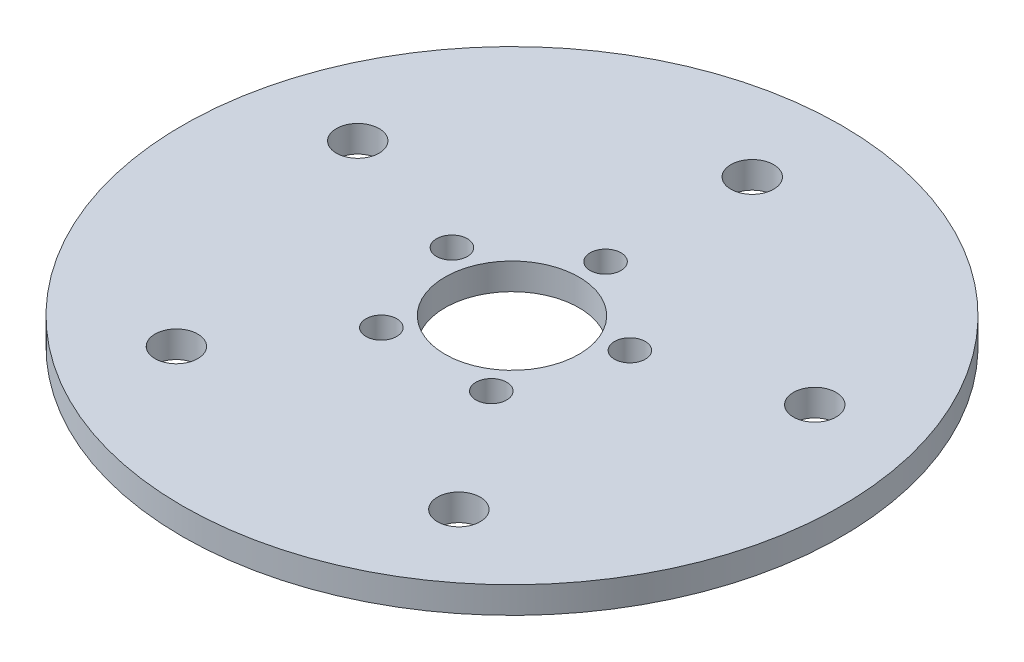
ISO-10303-21;
HEADER;
FILE_DESCRIPTION(('STEP AP214'),'2;1');
FILE_NAME('part.step','',(''),(''),'','','');
FILE_SCHEMA(('AUTOMOTIVE_DESIGN { 1 0 10303 214 1 1 1 1 }'));
ENDSEC;
DATA;
#1=APPLICATION_CONTEXT('core data for automotive mechanical design processes');
#2=APPLICATION_PROTOCOL_DEFINITION('international standard','automotive_design',2000,#1);
#3=PRODUCT_CONTEXT('',#1,'mechanical');
#4=PRODUCT('Part','Part','',(#3));
#5=PRODUCT_RELATED_PRODUCT_CATEGORY('part','',(#4));
#6=PRODUCT_DEFINITION_FORMATION('','',#4);
#7=PRODUCT_DEFINITION_CONTEXT('part definition',#1,'design');
#8=PRODUCT_DEFINITION('design','',#6,#7);
#9=PRODUCT_DEFINITION_SHAPE('','',#8);
#10=(LENGTH_UNIT() NAMED_UNIT(*) SI_UNIT(.MILLI.,.METRE.));
#11=(NAMED_UNIT(*) PLANE_ANGLE_UNIT() SI_UNIT($,.RADIAN.));
#12=(NAMED_UNIT(*) SI_UNIT($,.STERADIAN.) SOLID_ANGLE_UNIT());
#13=UNCERTAINTY_MEASURE_WITH_UNIT(LENGTH_MEASURE(1.E-05),#10,'distance_accuracy_value','');
#14=(GEOMETRIC_REPRESENTATION_CONTEXT(3) GLOBAL_UNCERTAINTY_ASSIGNED_CONTEXT((#13)) GLOBAL_UNIT_ASSIGNED_CONTEXT((#10,
#11,#12)) REPRESENTATION_CONTEXT('',''));
#15=CARTESIAN_POINT('',(0.,0.,0.));
#16=DIRECTION('',(0.,0.,1.));
#17=DIRECTION('',(1.,0.,0.));
#18=AXIS2_PLACEMENT_3D('',#15,#16,#17);
#19=CARTESIAN_POINT('',(0.,803.941424119783,-1.40859720825637E-13));
#20=DIRECTION('',(0.,1.,0.));
#21=DIRECTION('',(0.,0.,1.));
#22=AXIS2_PLACEMENT_3D('',#19,#20,#21);
#23=CYLINDRICAL_SURFACE('',#22,39.37);
#24=CARTESIAN_POINT('',(0.,803.941424119783,-1.40859720825637E-13));
#25=DIRECTION('',(0.,1.,0.));
#26=DIRECTION('',(0.,0.,1.));
#27=AXIS2_PLACEMENT_3D('',#24,#25,#26);
#28=CIRCLE('',#27,39.37);
#29=CARTESIAN_POINT('',(0.,803.941424119783,39.3699999999999));
#30=VERTEX_POINT('',#29);
#31=EDGE_CURVE('E10',#30,#30,#28,.T.);
#32=ORIENTED_EDGE('',*,*,#31,.T.);
#33=EDGE_LOOP('',(#32));
#34=FACE_BOUND('',#33,.T.);
#35=CARTESIAN_POINT('',(0.,807.116424119783,-1.41054133505002E-13));
#36=DIRECTION('',(0.,1.,0.));
#37=DIRECTION('',(0.,0.,1.));
#38=AXIS2_PLACEMENT_3D('',#35,#36,#37);
#39=CIRCLE('',#38,39.37);
#40=CARTESIAN_POINT('',(0.,807.116424119783,39.3699999999999));
#41=VERTEX_POINT('',#40);
#42=EDGE_CURVE('E40',#41,#41,#39,.T.);
#43=ORIENTED_EDGE('',*,*,#42,.F.);
#44=EDGE_LOOP('',(#43));
#45=FACE_BOUND('',#44,.T.);
#46=ADVANCED_FACE('F37',(#34,#45),#23,.T.);
#47=CARTESIAN_POINT('',(0.,803.941424119783,-1.40859720825637E-13));
#48=DIRECTION('',(0.,1.,0.));
#49=DIRECTION('',(0.,0.,1.));
#50=AXIS2_PLACEMENT_3D('',#47,#48,#49);
#51=PLANE('',#50);
#52=CARTESIAN_POINT('',(-27.2972241307035,803.941424119783,-8.8694057725499));
#53=DIRECTION('',(0.,1.,0.));
#54=DIRECTION('',(0.,0.,1.));
#55=AXIS2_PLACEMENT_3D('',#52,#53,#54);
#56=CIRCLE('',#55,2.5527);
#57=CARTESIAN_POINT('',(-27.2972241307035,803.941424119783,-6.3167057725499));
#58=VERTEX_POINT('',#57);
#59=EDGE_CURVE('E55',#58,#58,#56,.T.);
#60=ORIENTED_EDGE('',*,*,#59,.T.);
#61=EDGE_LOOP('',(#60));
#62=FACE_BOUND('',#61,.T.);
#63=CARTESIAN_POINT('',(-16.8706123112986,803.941424119783,23.2204057725496));
#64=DIRECTION('',(0.,1.,0.));
#65=DIRECTION('',(0.,0.,1.));
#66=AXIS2_PLACEMENT_3D('',#63,#64,#65);
#67=CIRCLE('',#66,2.5527);
#68=CARTESIAN_POINT('',(-16.8706123112986,803.941424119783,25.7731057725496));
#69=VERTEX_POINT('',#68);
#70=EDGE_CURVE('E61',#69,#69,#67,.T.);
#71=ORIENTED_EDGE('',*,*,#70,.T.);
#72=EDGE_LOOP('',(#71));
#73=FACE_BOUND('',#72,.T.);
#74=CARTESIAN_POINT('',(6.56908797962068,803.941424119783,9.04157392913436));
#75=DIRECTION('',(0.,1.,0.));
#76=DIRECTION('',(0.,0.,1.));
#77=AXIS2_PLACEMENT_3D('',#74,#75,#76);
#78=CIRCLE('',#77,1.84150000000011);
#79=CARTESIAN_POINT('',(6.56908797962068,803.941424119783,10.8830739291345));
#80=VERTEX_POINT('',#79);
#81=EDGE_CURVE('E80',#80,#80,#78,.T.);
#82=ORIENTED_EDGE('',*,*,#81,.T.);
#83=EDGE_LOOP('',(#82));
#84=FACE_BOUND('',#83,.T.);
#85=CARTESIAN_POINT('',(0.,803.941424119783,-28.7020000000001));
#86=DIRECTION('',(0.,1.,0.));
#87=DIRECTION('',(0.,0.,1.));
#88=AXIS2_PLACEMENT_3D('',#85,#86,#87);
#89=CIRCLE('',#88,2.5527);
#90=CARTESIAN_POINT('',(0.,803.941424119783,-26.1493000000001));
#91=VERTEX_POINT('',#90);
#92=EDGE_CURVE('E87',#91,#91,#89,.T.);
#93=ORIENTED_EDGE('',*,*,#92,.T.);
#94=EDGE_LOOP('',(#93));
#95=FACE_BOUND('',#94,.T.);
#96=CARTESIAN_POINT('',(10.6290076261146,803.941424119783,-3.45357392913442));
#97=DIRECTION('',(0.,1.,0.));
#98=DIRECTION('',(0.,0.,1.));
#99=AXIS2_PLACEMENT_3D('',#96,#97,#98);
#100=CIRCLE('',#99,1.84150000000005);
#101=CARTESIAN_POINT('',(10.6290076261146,803.941424119783,-1.61207392913437));
#102=VERTEX_POINT('',#101);
#103=EDGE_CURVE('E68',#102,#102,#100,.T.);
#104=ORIENTED_EDGE('',*,*,#103,.T.);
#105=EDGE_LOOP('',(#104));
#106=FACE_BOUND('',#105,.T.);
#107=CARTESIAN_POINT('',(0.,803.941424119783,-11.1760000000001));
#108=DIRECTION('',(0.,1.,0.));
#109=DIRECTION('',(0.,0.,1.));
#110=AXIS2_PLACEMENT_3D('',#107,#108,#109);
#111=CIRCLE('',#110,1.84150000000004);
#112=CARTESIAN_POINT('',(0.,803.941424119783,-9.33450000000008));
#113=VERTEX_POINT('',#112);
#114=EDGE_CURVE('E75',#113,#113,#111,.T.);
#115=ORIENTED_EDGE('',*,*,#114,.T.);
#116=EDGE_LOOP('',(#115));
#117=FACE_BOUND('',#116,.T.);
#118=CARTESIAN_POINT('',(-6.56908797962076,803.941424119783,9.04157392913436));
#119=DIRECTION('',(0.,1.,0.));
#120=DIRECTION('',(0.,0.,1.));
#121=AXIS2_PLACEMENT_3D('',#118,#119,#120);
#122=CIRCLE('',#121,1.84150000000009);
#123=CARTESIAN_POINT('',(-6.56908797962076,803.941424119783,10.8830739291344));
#124=VERTEX_POINT('',#123);
#125=EDGE_CURVE('E109',#124,#124,#122,.T.);
#126=ORIENTED_EDGE('',*,*,#125,.T.);
#127=EDGE_LOOP('',(#126));
#128=FACE_BOUND('',#127,.T.);
#129=CARTESIAN_POINT('',(-10.6290076261147,803.941424119783,-3.45357392913442));
#130=DIRECTION('',(0.,1.,0.));
#131=DIRECTION('',(0.,0.,1.));
#132=AXIS2_PLACEMENT_3D('',#129,#130,#131);
#133=CIRCLE('',#132,1.84150000000005);
#134=CARTESIAN_POINT('',(-10.6290076261147,803.941424119783,-1.61207392913437));
#135=VERTEX_POINT('',#134);
#136=EDGE_CURVE('E103',#135,#135,#133,.T.);
#137=ORIENTED_EDGE('',*,*,#136,.T.);
#138=EDGE_LOOP('',(#137));
#139=FACE_BOUND('',#138,.T.);
#140=CARTESIAN_POINT('',(27.2972241307035,803.941424119783,-8.86940577254987));
#141=DIRECTION('',(0.,1.,0.));
#142=DIRECTION('',(0.,0.,1.));
#143=AXIS2_PLACEMENT_3D('',#140,#141,#142);
#144=CIRCLE('',#143,2.5527);
#145=CARTESIAN_POINT('',(27.2972241307035,803.941424119783,-6.31670577254987));
#146=VERTEX_POINT('',#145);
#147=EDGE_CURVE('E97',#146,#146,#144,.T.);
#148=ORIENTED_EDGE('',*,*,#147,.T.);
#149=EDGE_LOOP('',(#148));
#150=FACE_BOUND('',#149,.T.);
#151=CARTESIAN_POINT('',(16.8706123112985,803.941424119783,23.2204057725496));
#152=DIRECTION('',(0.,1.,0.));
#153=DIRECTION('',(0.,0.,1.));
#154=AXIS2_PLACEMENT_3D('',#151,#152,#153);
#155=CIRCLE('',#154,2.5527);
#156=CARTESIAN_POINT('',(16.8706123112985,803.941424119783,25.7731057725496));
#157=VERTEX_POINT('',#156);
#158=EDGE_CURVE('E67',#157,#157,#155,.T.);
#159=ORIENTED_EDGE('',*,*,#158,.T.);
#160=EDGE_LOOP('',(#159));
#161=FACE_BOUND('',#160,.T.);
#162=CARTESIAN_POINT('',(0.,803.941424119783,0.));
#163=DIRECTION('',(0.,1.,0.));
#164=DIRECTION('',(0.,0.,1.));
#165=AXIS2_PLACEMENT_3D('',#162,#163,#164);
#166=CIRCLE('',#165,8.00100000000001);
#167=CARTESIAN_POINT('',(0.,803.941424119783,8.00099999999996));
#168=VERTEX_POINT('',#167);
#169=EDGE_CURVE('E47',#168,#168,#166,.T.);
#170=ORIENTED_EDGE('',*,*,#169,.T.);
#171=EDGE_LOOP('',(#170));
#172=FACE_BOUND('',#171,.T.);
#173=ORIENTED_EDGE('',*,*,#31,.F.);
#174=EDGE_LOOP('',(#173));
#175=FACE_BOUND('',#174,.T.);
#176=ADVANCED_FACE('F121',(#62,#73,#84,#95,#106,#117,#128,#139,#150,#161,#172,#175),#51,.F.);
#177=CARTESIAN_POINT('',(0.,807.116424119783,-1.41054133505002E-13));
#178=DIRECTION('',(0.,1.,0.));
#179=DIRECTION('',(0.,0.,1.));
#180=AXIS2_PLACEMENT_3D('',#177,#178,#179);
#181=PLANE('',#180);
#182=CARTESIAN_POINT('',(-27.2972241307035,807.116424119783,-8.8694057725499));
#183=DIRECTION('',(0.,1.,0.));
#184=DIRECTION('',(0.,0.,1.));
#185=AXIS2_PLACEMENT_3D('',#182,#183,#184);
#186=CIRCLE('',#185,2.5527);
#187=CARTESIAN_POINT('',(-27.2972241307035,807.116424119783,-6.3167057725499));
#188=VERTEX_POINT('',#187);
#189=EDGE_CURVE('E58',#188,#188,#186,.T.);
#190=ORIENTED_EDGE('',*,*,#189,.F.);
#191=EDGE_LOOP('',(#190));
#192=FACE_BOUND('',#191,.T.);
#193=CARTESIAN_POINT('',(-16.8706123112986,807.116424119783,23.2204057725496));
#194=DIRECTION('',(0.,1.,0.));
#195=DIRECTION('',(0.,0.,1.));
#196=AXIS2_PLACEMENT_3D('',#193,#194,#195);
#197=CIRCLE('',#196,2.5527);
#198=CARTESIAN_POINT('',(-16.8706123112986,807.116424119783,25.7731057725496));
#199=VERTEX_POINT('',#198);
#200=EDGE_CURVE('E64',#199,#199,#197,.T.);
#201=ORIENTED_EDGE('',*,*,#200,.F.);
#202=EDGE_LOOP('',(#201));
#203=FACE_BOUND('',#202,.T.);
#204=CARTESIAN_POINT('',(6.56908797962068,807.116424119783,9.04157392913436));
#205=DIRECTION('',(0.,1.,0.));
#206=DIRECTION('',(0.,0.,1.));
#207=AXIS2_PLACEMENT_3D('',#204,#205,#206);
#208=CIRCLE('',#207,1.84150000000011);
#209=CARTESIAN_POINT('',(6.56908797962068,807.116424119783,10.8830739291345));
#210=VERTEX_POINT('',#209);
#211=EDGE_CURVE('E83',#210,#210,#208,.T.);
#212=ORIENTED_EDGE('',*,*,#211,.F.);
#213=EDGE_LOOP('',(#212));
#214=FACE_BOUND('',#213,.T.);
#215=CARTESIAN_POINT('',(0.,807.116424119783,-28.7020000000001));
#216=DIRECTION('',(0.,1.,0.));
#217=DIRECTION('',(0.,0.,1.));
#218=AXIS2_PLACEMENT_3D('',#215,#216,#217);
#219=CIRCLE('',#218,2.5527);
#220=CARTESIAN_POINT('',(0.,807.116424119783,-26.1493000000001));
#221=VERTEX_POINT('',#220);
#222=EDGE_CURVE('E72',#221,#221,#219,.T.);
#223=ORIENTED_EDGE('',*,*,#222,.F.);
#224=EDGE_LOOP('',(#223));
#225=FACE_BOUND('',#224,.T.);
#226=CARTESIAN_POINT('',(10.6290076261146,807.116424119783,-3.45357392913442));
#227=DIRECTION('',(0.,1.,0.));
#228=DIRECTION('',(0.,0.,1.));
#229=AXIS2_PLACEMENT_3D('',#226,#227,#228);
#230=CIRCLE('',#229,1.84150000000005);
#231=CARTESIAN_POINT('',(10.6290076261146,807.116424119783,-1.61207392913437));
#232=VERTEX_POINT('',#231);
#233=EDGE_CURVE('E71',#232,#232,#230,.T.);
#234=ORIENTED_EDGE('',*,*,#233,.F.);
#235=EDGE_LOOP('',(#234));
#236=FACE_BOUND('',#235,.T.);
#237=CARTESIAN_POINT('',(0.,807.116424119783,-11.1760000000001));
#238=DIRECTION('',(0.,1.,0.));
#239=DIRECTION('',(0.,0.,1.));
#240=AXIS2_PLACEMENT_3D('',#237,#238,#239);
#241=CIRCLE('',#240,1.84150000000004);
#242=CARTESIAN_POINT('',(0.,807.116424119783,-9.33450000000008));
#243=VERTEX_POINT('',#242);
#244=EDGE_CURVE('E52',#243,#243,#241,.T.);
#245=ORIENTED_EDGE('',*,*,#244,.F.);
#246=EDGE_LOOP('',(#245));
#247=FACE_BOUND('',#246,.T.);
#248=CARTESIAN_POINT('',(-6.56908797962076,807.116424119783,9.04157392913436));
#249=DIRECTION('',(0.,1.,0.));
#250=DIRECTION('',(0.,0.,1.));
#251=AXIS2_PLACEMENT_3D('',#248,#249,#250);
#252=CIRCLE('',#251,1.84150000000009);
#253=CARTESIAN_POINT('',(-6.56908797962076,807.116424119783,10.8830739291344));
#254=VERTEX_POINT('',#253);
#255=EDGE_CURVE('E84',#254,#254,#252,.T.);
#256=ORIENTED_EDGE('',*,*,#255,.F.);
#257=EDGE_LOOP('',(#256));
#258=FACE_BOUND('',#257,.T.);
#259=CARTESIAN_POINT('',(-10.6290076261147,807.116424119783,-3.45357392913442));
#260=DIRECTION('',(0.,1.,0.));
#261=DIRECTION('',(0.,0.,1.));
#262=AXIS2_PLACEMENT_3D('',#259,#260,#261);
#263=CIRCLE('',#262,1.84150000000005);
#264=CARTESIAN_POINT('',(-10.6290076261147,807.116424119783,-1.61207392913437));
#265=VERTEX_POINT('',#264);
#266=EDGE_CURVE('E106',#265,#265,#263,.T.);
#267=ORIENTED_EDGE('',*,*,#266,.F.);
#268=EDGE_LOOP('',(#267));
#269=FACE_BOUND('',#268,.T.);
#270=CARTESIAN_POINT('',(27.2972241307035,807.116424119783,-8.86940577254987));
#271=DIRECTION('',(0.,1.,0.));
#272=DIRECTION('',(0.,0.,1.));
#273=AXIS2_PLACEMENT_3D('',#270,#271,#272);
#274=CIRCLE('',#273,2.5527);
#275=CARTESIAN_POINT('',(27.2972241307035,807.116424119783,-6.31670577254987));
#276=VERTEX_POINT('',#275);
#277=EDGE_CURVE('E100',#276,#276,#274,.T.);
#278=ORIENTED_EDGE('',*,*,#277,.F.);
#279=EDGE_LOOP('',(#278));
#280=FACE_BOUND('',#279,.T.);
#281=CARTESIAN_POINT('',(16.8706123112985,807.116424119783,23.2204057725496));
#282=DIRECTION('',(0.,1.,0.));
#283=DIRECTION('',(0.,0.,1.));
#284=AXIS2_PLACEMENT_3D('',#281,#282,#283);
#285=CIRCLE('',#284,2.5527);
#286=CARTESIAN_POINT('',(16.8706123112985,807.116424119783,25.7731057725496));
#287=VERTEX_POINT('',#286);
#288=EDGE_CURVE('E94',#287,#287,#285,.T.);
#289=ORIENTED_EDGE('',*,*,#288,.F.);
#290=EDGE_LOOP('',(#289));
#291=FACE_BOUND('',#290,.T.);
#292=CARTESIAN_POINT('',(0.,807.116424119783,0.));
#293=DIRECTION('',(0.,1.,0.));
#294=DIRECTION('',(0.,0.,1.));
#295=AXIS2_PLACEMENT_3D('',#292,#293,#294);
#296=CIRCLE('',#295,8.00100000000001);
#297=CARTESIAN_POINT('',(0.,807.116424119783,8.00099999999996));
#298=VERTEX_POINT('',#297);
#299=EDGE_CURVE('E49',#298,#298,#296,.T.);
#300=ORIENTED_EDGE('',*,*,#299,.F.);
#301=EDGE_LOOP('',(#300));
#302=FACE_BOUND('',#301,.T.);
#303=ORIENTED_EDGE('',*,*,#42,.T.);
#304=EDGE_LOOP('',(#303));
#305=FACE_BOUND('',#304,.T.);
#306=ADVANCED_FACE('F117',(#192,#203,#214,#225,#236,#247,#258,#269,#280,#291,#302,#305),#181,.T.);
#307=CARTESIAN_POINT('',(0.,803.941424119783,0.));
#308=DIRECTION('',(0.,1.,0.));
#309=DIRECTION('',(0.,0.,1.));
#310=AXIS2_PLACEMENT_3D('',#307,#308,#309);
#311=CYLINDRICAL_SURFACE('',#310,8.00100000000001);
#312=ORIENTED_EDGE('',*,*,#169,.F.);
#313=EDGE_LOOP('',(#312));
#314=FACE_BOUND('',#313,.T.);
#315=ORIENTED_EDGE('',*,*,#299,.T.);
#316=EDGE_LOOP('',(#315));
#317=FACE_BOUND('',#316,.T.);
#318=ADVANCED_FACE('F120',(#314,#317),#311,.F.);
#319=CARTESIAN_POINT('',(16.8706123112985,803.941424119783,23.2204057725496));
#320=DIRECTION('',(0.,1.,0.));
#321=DIRECTION('',(0.,0.,1.));
#322=AXIS2_PLACEMENT_3D('',#319,#320,#321);
#323=CYLINDRICAL_SURFACE('',#322,2.5527);
#324=ORIENTED_EDGE('',*,*,#158,.F.);
#325=EDGE_LOOP('',(#324));
#326=FACE_BOUND('',#325,.T.);
#327=ORIENTED_EDGE('',*,*,#288,.T.);
#328=EDGE_LOOP('',(#327));
#329=FACE_BOUND('',#328,.T.);
#330=ADVANCED_FACE('F145',(#326,#329),#323,.F.);
#331=CARTESIAN_POINT('',(27.2972241307035,803.941424119783,-8.86940577254987));
#332=DIRECTION('',(0.,1.,0.));
#333=DIRECTION('',(0.,0.,1.));
#334=AXIS2_PLACEMENT_3D('',#331,#332,#333);
#335=CYLINDRICAL_SURFACE('',#334,2.5527);
#336=ORIENTED_EDGE('',*,*,#147,.F.);
#337=EDGE_LOOP('',(#336));
#338=FACE_BOUND('',#337,.T.);
#339=ORIENTED_EDGE('',*,*,#277,.T.);
#340=EDGE_LOOP('',(#339));
#341=FACE_BOUND('',#340,.T.);
#342=ADVANCED_FACE('F173',(#338,#341),#335,.F.);
#343=CARTESIAN_POINT('',(-10.6290076261147,803.941424119783,-3.45357392913442));
#344=DIRECTION('',(0.,1.,0.));
#345=DIRECTION('',(0.,0.,1.));
#346=AXIS2_PLACEMENT_3D('',#343,#344,#345);
#347=CYLINDRICAL_SURFACE('',#346,1.84150000000005);
#348=ORIENTED_EDGE('',*,*,#136,.F.);
#349=EDGE_LOOP('',(#348));
#350=FACE_BOUND('',#349,.T.);
#351=ORIENTED_EDGE('',*,*,#266,.T.);
#352=EDGE_LOOP('',(#351));
#353=FACE_BOUND('',#352,.T.);
#354=ADVANCED_FACE('F177',(#350,#353),#347,.F.);
#355=CARTESIAN_POINT('',(-6.56908797962076,803.941424119783,9.04157392913436));
#356=DIRECTION('',(0.,1.,0.));
#357=DIRECTION('',(0.,0.,1.));
#358=AXIS2_PLACEMENT_3D('',#355,#356,#357);
#359=CYLINDRICAL_SURFACE('',#358,1.84150000000009);
#360=ORIENTED_EDGE('',*,*,#125,.F.);
#361=EDGE_LOOP('',(#360));
#362=FACE_BOUND('',#361,.T.);
#363=ORIENTED_EDGE('',*,*,#255,.T.);
#364=EDGE_LOOP('',(#363));
#365=FACE_BOUND('',#364,.T.);
#366=ADVANCED_FACE('F115',(#362,#365),#359,.F.);
#367=CARTESIAN_POINT('',(0.,803.941424119783,-11.1760000000001));
#368=DIRECTION('',(0.,1.,0.));
#369=DIRECTION('',(0.,0.,1.));
#370=AXIS2_PLACEMENT_3D('',#367,#368,#369);
#371=CYLINDRICAL_SURFACE('',#370,1.84150000000004);
#372=ORIENTED_EDGE('',*,*,#114,.F.);
#373=EDGE_LOOP('',(#372));
#374=FACE_BOUND('',#373,.T.);
#375=ORIENTED_EDGE('',*,*,#244,.T.);
#376=EDGE_LOOP('',(#375));
#377=FACE_BOUND('',#376,.T.);
#378=ADVANCED_FACE('F160',(#374,#377),#371,.F.);
#379=CARTESIAN_POINT('',(10.6290076261146,803.941424119783,-3.45357392913442));
#380=DIRECTION('',(0.,1.,0.));
#381=DIRECTION('',(0.,0.,1.));
#382=AXIS2_PLACEMENT_3D('',#379,#380,#381);
#383=CYLINDRICAL_SURFACE('',#382,1.84150000000005);
#384=ORIENTED_EDGE('',*,*,#103,.F.);
#385=EDGE_LOOP('',(#384));
#386=FACE_BOUND('',#385,.T.);
#387=ORIENTED_EDGE('',*,*,#233,.T.);
#388=EDGE_LOOP('',(#387));
#389=FACE_BOUND('',#388,.T.);
#390=ADVANCED_FACE('F156',(#386,#389),#383,.F.);
#391=CARTESIAN_POINT('',(0.,803.941424119783,-28.7020000000001));
#392=DIRECTION('',(0.,1.,0.));
#393=DIRECTION('',(0.,0.,1.));
#394=AXIS2_PLACEMENT_3D('',#391,#392,#393);
#395=CYLINDRICAL_SURFACE('',#394,2.5527);
#396=ORIENTED_EDGE('',*,*,#92,.F.);
#397=EDGE_LOOP('',(#396));
#398=FACE_BOUND('',#397,.T.);
#399=ORIENTED_EDGE('',*,*,#222,.T.);
#400=EDGE_LOOP('',(#399));
#401=FACE_BOUND('',#400,.T.);
#402=ADVANCED_FACE('F159',(#398,#401),#395,.F.);
#403=CARTESIAN_POINT('',(6.56908797962068,803.941424119783,9.04157392913436));
#404=DIRECTION('',(0.,1.,0.));
#405=DIRECTION('',(0.,0.,1.));
#406=AXIS2_PLACEMENT_3D('',#403,#404,#405);
#407=CYLINDRICAL_SURFACE('',#406,1.84150000000011);
#408=ORIENTED_EDGE('',*,*,#81,.F.);
#409=EDGE_LOOP('',(#408));
#410=FACE_BOUND('',#409,.T.);
#411=ORIENTED_EDGE('',*,*,#211,.T.);
#412=EDGE_LOOP('',(#411));
#413=FACE_BOUND('',#412,.T.);
#414=ADVANCED_FACE('F154',(#410,#413),#407,.F.);
#415=CARTESIAN_POINT('',(-16.8706123112986,803.941424119783,23.2204057725496));
#416=DIRECTION('',(0.,1.,0.));
#417=DIRECTION('',(0.,0.,1.));
#418=AXIS2_PLACEMENT_3D('',#415,#416,#417);
#419=CYLINDRICAL_SURFACE('',#418,2.5527);
#420=ORIENTED_EDGE('',*,*,#70,.F.);
#421=EDGE_LOOP('',(#420));
#422=FACE_BOUND('',#421,.T.);
#423=ORIENTED_EDGE('',*,*,#200,.T.);
#424=EDGE_LOOP('',(#423));
#425=FACE_BOUND('',#424,.T.);
#426=ADVANCED_FACE('F150',(#422,#425),#419,.F.);
#427=CARTESIAN_POINT('',(-27.2972241307035,803.941424119783,-8.8694057725499));
#428=DIRECTION('',(0.,1.,0.));
#429=DIRECTION('',(0.,0.,1.));
#430=AXIS2_PLACEMENT_3D('',#427,#428,#429);
#431=CYLINDRICAL_SURFACE('',#430,2.5527);
#432=ORIENTED_EDGE('',*,*,#59,.F.);
#433=EDGE_LOOP('',(#432));
#434=FACE_BOUND('',#433,.T.);
#435=ORIENTED_EDGE('',*,*,#189,.T.);
#436=EDGE_LOOP('',(#435));
#437=FACE_BOUND('',#436,.T.);
#438=ADVANCED_FACE('F147',(#434,#437),#431,.F.);
#439=CLOSED_SHELL('',(#46,#176,#306,#318,#330,#342,#354,#366,#378,#390,#402,#414,#426,#438));
#440=MANIFOLD_SOLID_BREP('B2',#439);
#441=ADVANCED_BREP_SHAPE_REPRESENTATION('',(#18,#440),#14);
#442=SHAPE_DEFINITION_REPRESENTATION(#9,#441);
ENDSEC;
END-ISO-10303-21;
